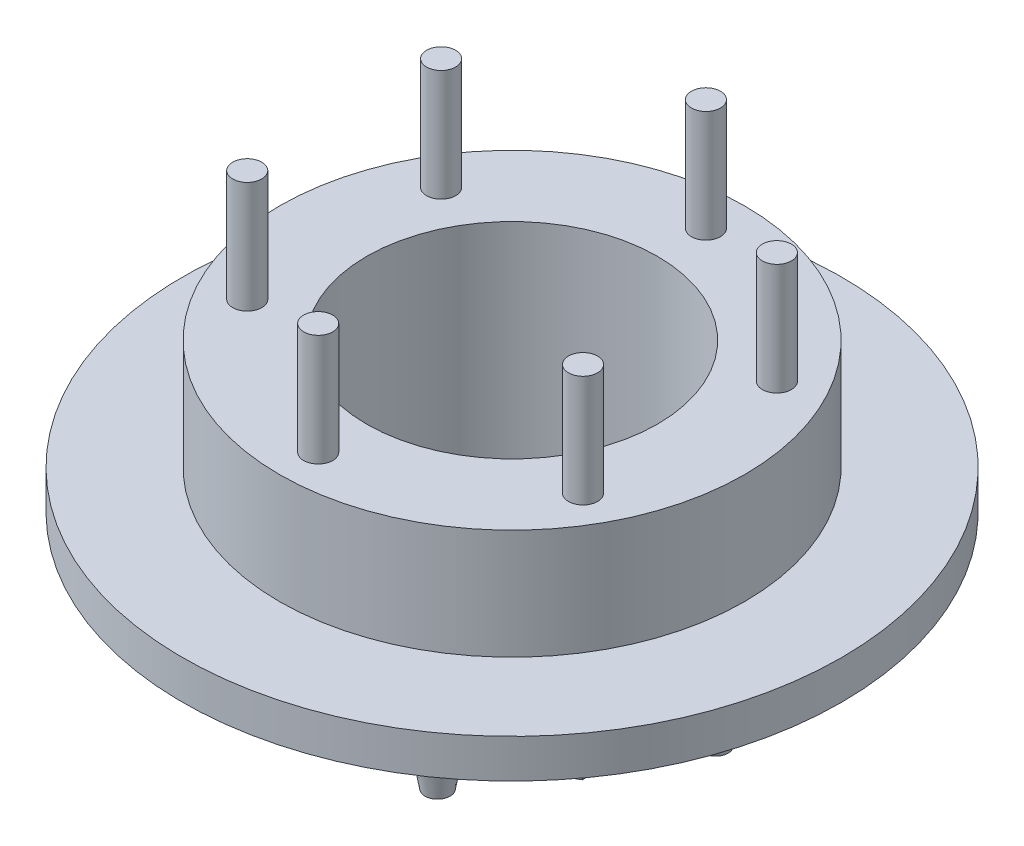
ISO-10303-21;
HEADER;
FILE_DESCRIPTION(('STEP AP214'),'2;1');
FILE_NAME('part.step','',(''),(''),'','','');
FILE_SCHEMA(('AUTOMOTIVE_DESIGN { 1 0 10303 214 1 1 1 1 }'));
ENDSEC;
DATA;
#1=APPLICATION_CONTEXT('core data for automotive mechanical design processes');
#2=APPLICATION_PROTOCOL_DEFINITION('international standard','automotive_design',2000,#1);
#3=PRODUCT_CONTEXT('',#1,'mechanical');
#4=PRODUCT('Part','Part','',(#3));
#5=PRODUCT_RELATED_PRODUCT_CATEGORY('part','',(#4));
#6=PRODUCT_DEFINITION_FORMATION('','',#4);
#7=PRODUCT_DEFINITION_CONTEXT('part definition',#1,'design');
#8=PRODUCT_DEFINITION('design','',#6,#7);
#9=PRODUCT_DEFINITION_SHAPE('','',#8);
#10=(LENGTH_UNIT() NAMED_UNIT(*) SI_UNIT(.MILLI.,.METRE.));
#11=(NAMED_UNIT(*) PLANE_ANGLE_UNIT() SI_UNIT($,.RADIAN.));
#12=(NAMED_UNIT(*) SI_UNIT($,.STERADIAN.) SOLID_ANGLE_UNIT());
#13=UNCERTAINTY_MEASURE_WITH_UNIT(LENGTH_MEASURE(1.E-05),#10,'distance_accuracy_value','');
#14=(GEOMETRIC_REPRESENTATION_CONTEXT(3) GLOBAL_UNCERTAINTY_ASSIGNED_CONTEXT((#13)) GLOBAL_UNIT_ASSIGNED_CONTEXT((#10,
#11,#12)) REPRESENTATION_CONTEXT('',''));
#15=CARTESIAN_POINT('',(0.,0.,0.));
#16=DIRECTION('',(0.,0.,1.));
#17=DIRECTION('',(1.,0.,0.));
#18=AXIS2_PLACEMENT_3D('',#15,#16,#17);
#19=CARTESIAN_POINT('',(0.,10.875,0.));
#20=DIRECTION('',(0.,-1.,0.));
#21=DIRECTION('',(0.,0.,-1.));
#22=AXIS2_PLACEMENT_3D('',#19,#20,#21);
#23=CYLINDRICAL_SURFACE('',#22,12.);
#24=CARTESIAN_POINT('',(0.,5.19999999999999,0.));
#25=DIRECTION('',(0.,-1.,0.));
#26=DIRECTION('',(1.,0.,0.));
#27=AXIS2_PLACEMENT_3D('',#24,#25,#26);
#28=CIRCLE('',#27,12.);
#29=CARTESIAN_POINT('',(12.,5.2,0.));
#30=VERTEX_POINT('',#29);
#31=EDGE_CURVE('E230',#30,#30,#28,.T.);
#32=ORIENTED_EDGE('',*,*,#31,.F.);
#33=EDGE_LOOP('',(#32));
#34=FACE_BOUND('',#33,.T.);
#35=CARTESIAN_POINT('',(0.,10.875,0.));
#36=DIRECTION('',(0.,1.,0.));
#37=DIRECTION('',(0.,0.,1.));
#38=AXIS2_PLACEMENT_3D('',#35,#36,#37);
#39=CIRCLE('',#38,12.);
#40=CARTESIAN_POINT('',(0.,10.875,12.));
#41=VERTEX_POINT('',#40);
#42=EDGE_CURVE('E152',#41,#41,#39,.T.);
#43=ORIENTED_EDGE('',*,*,#42,.F.);
#44=EDGE_LOOP('',(#43));
#45=FACE_BOUND('',#44,.T.);
#46=ADVANCED_FACE('F32',(#34,#45),#23,.T.);
#47=CARTESIAN_POINT('',(0.,0.,0.));
#48=DIRECTION('',(0.,1.,0.));
#49=DIRECTION('',(0.,0.,1.));
#50=AXIS2_PLACEMENT_3D('',#47,#48,#49);
#51=PLANE('',#50);
#52=CARTESIAN_POINT('',(-10.5,0.,0.));
#53=DIRECTION('',(0.,1.,0.));
#54=DIRECTION('',(0.,0.,1.));
#55=AXIS2_PLACEMENT_3D('',#52,#53,#54);
#56=CIRCLE('',#55,1.);
#57=CARTESIAN_POINT('',(-10.5,0.,1.));
#58=VERTEX_POINT('',#57);
#59=EDGE_CURVE('E11',#58,#58,#56,.F.);
#60=ORIENTED_EDGE('',*,*,#59,.F.);
#61=EDGE_LOOP('',(#60));
#62=FACE_BOUND('',#61,.T.);
#63=CARTESIAN_POINT('',(-5.24999999999999,0.,-9.09326673973661));
#64=DIRECTION('',(0.,1.,0.));
#65=DIRECTION('',(0.,0.,1.));
#66=AXIS2_PLACEMENT_3D('',#63,#64,#65);
#67=CIRCLE('',#66,1.);
#68=CARTESIAN_POINT('',(-5.24999999999999,0.,-8.09326673973661));
#69=VERTEX_POINT('',#68);
#70=EDGE_CURVE('E40',#69,#69,#67,.F.);
#71=ORIENTED_EDGE('',*,*,#70,.F.);
#72=EDGE_LOOP('',(#71));
#73=FACE_BOUND('',#72,.T.);
#74=CARTESIAN_POINT('',(5.25,0.,-9.09326673973661));
#75=DIRECTION('',(0.,1.,0.));
#76=DIRECTION('',(0.,0.,1.));
#77=AXIS2_PLACEMENT_3D('',#74,#75,#76);
#78=CIRCLE('',#77,1.);
#79=CARTESIAN_POINT('',(5.25,0.,-8.09326673973661));
#80=VERTEX_POINT('',#79);
#81=EDGE_CURVE('E166',#80,#80,#78,.F.);
#82=ORIENTED_EDGE('',*,*,#81,.F.);
#83=EDGE_LOOP('',(#82));
#84=FACE_BOUND('',#83,.T.);
#85=CARTESIAN_POINT('',(10.5,0.,0.));
#86=DIRECTION('',(0.,1.,0.));
#87=DIRECTION('',(0.,0.,1.));
#88=AXIS2_PLACEMENT_3D('',#85,#86,#87);
#89=CIRCLE('',#88,1.);
#90=CARTESIAN_POINT('',(10.5,0.,1.));
#91=VERTEX_POINT('',#90);
#92=EDGE_CURVE('E163',#91,#91,#89,.F.);
#93=ORIENTED_EDGE('',*,*,#92,.F.);
#94=EDGE_LOOP('',(#93));
#95=FACE_BOUND('',#94,.T.);
#96=CARTESIAN_POINT('',(5.25,0.,9.09326673973661));
#97=DIRECTION('',(0.,1.,0.));
#98=DIRECTION('',(0.,0.,1.));
#99=AXIS2_PLACEMENT_3D('',#96,#97,#98);
#100=CIRCLE('',#99,1.);
#101=CARTESIAN_POINT('',(5.25,0.,10.0932667397366));
#102=VERTEX_POINT('',#101);
#103=EDGE_CURVE('E160',#102,#102,#100,.F.);
#104=ORIENTED_EDGE('',*,*,#103,.F.);
#105=EDGE_LOOP('',(#104));
#106=FACE_BOUND('',#105,.T.);
#107=CARTESIAN_POINT('',(-5.25,0.,9.09326673973661));
#108=DIRECTION('',(0.,1.,0.));
#109=DIRECTION('',(0.,0.,1.));
#110=AXIS2_PLACEMENT_3D('',#107,#108,#109);
#111=CIRCLE('',#110,1.);
#112=CARTESIAN_POINT('',(-5.25,0.,10.0932667397366));
#113=VERTEX_POINT('',#112);
#114=EDGE_CURVE('E155',#113,#113,#111,.F.);
#115=ORIENTED_EDGE('',*,*,#114,.F.);
#116=EDGE_LOOP('',(#115));
#117=FACE_BOUND('',#116,.T.);
#118=CARTESIAN_POINT('',(0.,0.,0.));
#119=DIRECTION('',(0.,1.,0.));
#120=DIRECTION('',(0.,0.,1.));
#121=AXIS2_PLACEMENT_3D('',#118,#119,#120);
#122=CIRCLE('',#121,12.);
#123=CARTESIAN_POINT('',(0.,0.,12.));
#124=VERTEX_POINT('',#123);
#125=EDGE_CURVE('E151',#124,#124,#122,.T.);
#126=ORIENTED_EDGE('',*,*,#125,.F.);
#127=EDGE_LOOP('',(#126));
#128=FACE_BOUND('',#127,.T.);
#129=DIRECTION('',(-0.866025403784439,0.,0.5));
#130=VECTOR('',#129,1.);
#131=CARTESIAN_POINT('',(8.57365149746594,0.,4.95));
#132=LINE('',#131,#130);
#133=CARTESIAN_POINT('',(8.57365149746594,0.,4.95));
#134=VERTEX_POINT('',#133);
#135=CARTESIAN_POINT('',(0.,0.,9.9));
#136=VERTEX_POINT('',#135);
#137=EDGE_CURVE('E106',#134,#136,#132,.T.);
#138=ORIENTED_EDGE('',*,*,#137,.F.);
#139=DIRECTION('',(0.,0.,1.));
#140=VECTOR('',#139,1.);
#141=CARTESIAN_POINT('',(8.57365149746594,0.,-4.95));
#142=LINE('',#141,#140);
#143=CARTESIAN_POINT('',(8.57365149746594,0.,-4.95));
#144=VERTEX_POINT('',#143);
#145=EDGE_CURVE('E103',#144,#134,#142,.T.);
#146=ORIENTED_EDGE('',*,*,#145,.F.);
#147=DIRECTION('',(0.866025403784439,0.,0.5));
#148=VECTOR('',#147,1.);
#149=CARTESIAN_POINT('',(0.,0.,-9.9));
#150=LINE('',#149,#148);
#151=CARTESIAN_POINT('',(0.,0.,-9.9));
#152=VERTEX_POINT('',#151);
#153=EDGE_CURVE('E197',#152,#144,#150,.T.);
#154=ORIENTED_EDGE('',*,*,#153,.F.);
#155=DIRECTION('',(0.866025403784439,0.,-0.5));
#156=VECTOR('',#155,1.);
#157=CARTESIAN_POINT('',(-8.57365149746594,0.,-4.95));
#158=LINE('',#157,#156);
#159=CARTESIAN_POINT('',(-8.57365149746594,0.,-4.95));
#160=VERTEX_POINT('',#159);
#161=EDGE_CURVE('E214',#160,#152,#158,.T.);
#162=ORIENTED_EDGE('',*,*,#161,.F.);
#163=DIRECTION('',(0.,0.,-1.));
#164=VECTOR('',#163,1.);
#165=CARTESIAN_POINT('',(-8.57365149746594,0.,4.95));
#166=LINE('',#165,#164);
#167=CARTESIAN_POINT('',(-8.57365149746594,0.,4.95));
#168=VERTEX_POINT('',#167);
#169=EDGE_CURVE('E52',#168,#160,#166,.T.);
#170=ORIENTED_EDGE('',*,*,#169,.F.);
#171=DIRECTION('',(-0.866025403784439,0.,-0.5));
#172=VECTOR('',#171,1.);
#173=CARTESIAN_POINT('',(0.,0.,9.9));
#174=LINE('',#173,#172);
#175=EDGE_CURVE('E47',#136,#168,#174,.T.);
#176=ORIENTED_EDGE('',*,*,#175,.F.);
#177=EDGE_LOOP('',(#138,#146,#154,#162,#170,#176));
#178=FACE_BOUND('',#177,.T.);
#179=ADVANCED_FACE('F173',(#62,#73,#84,#95,#106,#117,#128,#178),#51,.F.);
#180=CARTESIAN_POINT('',(0.,10.875,0.));
#181=DIRECTION('',(0.,1.,0.));
#182=DIRECTION('',(0.,0.,1.));
#183=AXIS2_PLACEMENT_3D('',#180,#181,#182);
#184=PLANE('',#183);
#185=CARTESIAN_POINT('',(8.66025403784439,10.875,-5.00000000000001));
#186=DIRECTION('',(0.,1.,0.));
#187=DIRECTION('',(0.,0.,1.));
#188=AXIS2_PLACEMENT_3D('',#185,#186,#187);
#189=CIRCLE('',#188,0.75);
#190=CARTESIAN_POINT('',(8.66025403784439,10.875,-4.25));
#191=VERTEX_POINT('',#190);
#192=EDGE_CURVE('E107',#191,#191,#189,.T.);
#193=ORIENTED_EDGE('',*,*,#192,.F.);
#194=EDGE_LOOP('',(#193));
#195=FACE_BOUND('',#194,.T.);
#196=CARTESIAN_POINT('',(8.66025403784439,10.875,5.));
#197=DIRECTION('',(0.,1.,0.));
#198=DIRECTION('',(0.,0.,1.));
#199=AXIS2_PLACEMENT_3D('',#196,#197,#198);
#200=CIRCLE('',#199,0.75);
#201=CARTESIAN_POINT('',(8.66025403784439,10.875,5.75));
#202=VERTEX_POINT('',#201);
#203=EDGE_CURVE('E117',#202,#202,#200,.T.);
#204=ORIENTED_EDGE('',*,*,#203,.F.);
#205=EDGE_LOOP('',(#204));
#206=FACE_BOUND('',#205,.T.);
#207=CARTESIAN_POINT('',(0.,10.875,10.));
#208=DIRECTION('',(0.,1.,0.));
#209=DIRECTION('',(0.,0.,1.));
#210=AXIS2_PLACEMENT_3D('',#207,#208,#209);
#211=CIRCLE('',#210,0.75);
#212=CARTESIAN_POINT('',(0.,10.875,10.75));
#213=VERTEX_POINT('',#212);
#214=EDGE_CURVE('E122',#213,#213,#211,.T.);
#215=ORIENTED_EDGE('',*,*,#214,.F.);
#216=EDGE_LOOP('',(#215));
#217=FACE_BOUND('',#216,.T.);
#218=CARTESIAN_POINT('',(-8.66025403784439,10.875,5.));
#219=DIRECTION('',(0.,1.,0.));
#220=DIRECTION('',(0.,0.,1.));
#221=AXIS2_PLACEMENT_3D('',#218,#219,#220);
#222=CIRCLE('',#221,0.75);
#223=CARTESIAN_POINT('',(-8.66025403784439,10.875,5.75));
#224=VERTEX_POINT('',#223);
#225=EDGE_CURVE('E128',#224,#224,#222,.T.);
#226=ORIENTED_EDGE('',*,*,#225,.F.);
#227=EDGE_LOOP('',(#226));
#228=FACE_BOUND('',#227,.T.);
#229=CARTESIAN_POINT('',(-8.66025403784439,10.875,-5.));
#230=DIRECTION('',(0.,1.,0.));
#231=DIRECTION('',(0.,0.,1.));
#232=AXIS2_PLACEMENT_3D('',#229,#230,#231);
#233=CIRCLE('',#232,0.75);
#234=CARTESIAN_POINT('',(-8.66025403784439,10.875,-4.25));
#235=VERTEX_POINT('',#234);
#236=EDGE_CURVE('E134',#235,#235,#233,.T.);
#237=ORIENTED_EDGE('',*,*,#236,.F.);
#238=EDGE_LOOP('',(#237));
#239=FACE_BOUND('',#238,.T.);
#240=CARTESIAN_POINT('',(0.,10.875,-10.));
#241=DIRECTION('',(0.,1.,0.));
#242=DIRECTION('',(0.,0.,1.));
#243=AXIS2_PLACEMENT_3D('',#240,#241,#242);
#244=CIRCLE('',#243,0.75);
#245=CARTESIAN_POINT('',(0.,10.875,-9.25));
#246=VERTEX_POINT('',#245);
#247=EDGE_CURVE('E140',#246,#246,#244,.T.);
#248=ORIENTED_EDGE('',*,*,#247,.F.);
#249=EDGE_LOOP('',(#248));
#250=FACE_BOUND('',#249,.T.);
#251=ORIENTED_EDGE('',*,*,#42,.T.);
#252=EDGE_LOOP('',(#251));
#253=FACE_BOUND('',#252,.T.);
#254=CARTESIAN_POINT('',(0.,10.875,0.));
#255=DIRECTION('',(0.,1.,0.));
#256=DIRECTION('',(0.,0.,1.));
#257=AXIS2_PLACEMENT_3D('',#254,#255,#256);
#258=CIRCLE('',#257,7.5);
#259=CARTESIAN_POINT('',(0.,10.875,7.5));
#260=VERTEX_POINT('',#259);
#261=EDGE_CURVE('E146',#260,#260,#258,.T.);
#262=ORIENTED_EDGE('',*,*,#261,.F.);
#263=EDGE_LOOP('',(#262));
#264=FACE_BOUND('',#263,.T.);
#265=ADVANCED_FACE('F176',(#195,#206,#217,#228,#239,#250,#253,#264),#184,.T.);
#266=CARTESIAN_POINT('',(0.,3.19999999999999,0.));
#267=DIRECTION('',(0.,-1.,0.));
#268=DIRECTION('',(1.,0.,0.));
#269=AXIS2_PLACEMENT_3D('',#266,#267,#268);
#270=CIRCLE('',#269,12.);
#271=CARTESIAN_POINT('',(12.,3.2,0.));
#272=VERTEX_POINT('',#271);
#273=EDGE_CURVE('E239',#272,#272,#270,.T.);
#274=ORIENTED_EDGE('',*,*,#273,.T.);
#275=EDGE_LOOP('',(#274));
#276=FACE_BOUND('',#275,.T.);
#277=ORIENTED_EDGE('',*,*,#125,.T.);
#278=EDGE_LOOP('',(#277));
#279=FACE_BOUND('',#278,.T.);
#280=ADVANCED_FACE('F34',(#276,#279),#23,.T.);
#281=CARTESIAN_POINT('',(0.,10.875,0.));
#282=DIRECTION('',(0.,-1.,0.));
#283=DIRECTION('',(0.,0.,-1.));
#284=AXIS2_PLACEMENT_3D('',#281,#282,#283);
#285=CYLINDRICAL_SURFACE('',#284,7.5);
#286=ORIENTED_EDGE('',*,*,#261,.T.);
#287=EDGE_LOOP('',(#286));
#288=FACE_BOUND('',#287,.T.);
#289=CARTESIAN_POINT('',(0.,-2.,0.));
#290=DIRECTION('',(0.,-1.,0.));
#291=DIRECTION('',(0.,0.,-1.));
#292=AXIS2_PLACEMENT_3D('',#289,#290,#291);
#293=CIRCLE('',#292,7.5);
#294=CARTESIAN_POINT('',(0.,-2.,-7.5));
#295=VERTEX_POINT('',#294);
#296=EDGE_CURVE('E189',#295,#295,#293,.T.);
#297=ORIENTED_EDGE('',*,*,#296,.T.);
#298=EDGE_LOOP('',(#297));
#299=FACE_BOUND('',#298,.T.);
#300=ADVANCED_FACE('F283',(#288,#299),#285,.F.);
#301=CARTESIAN_POINT('',(0.,16.625,-10.));
#302=DIRECTION('',(0.,-1.,0.));
#303=DIRECTION('',(0.,0.,-1.));
#304=AXIS2_PLACEMENT_3D('',#301,#302,#303);
#305=CYLINDRICAL_SURFACE('',#304,0.75);
#306=CARTESIAN_POINT('',(0.,16.625,-10.));
#307=DIRECTION('',(0.,1.,0.));
#308=DIRECTION('',(0.,0.,1.));
#309=AXIS2_PLACEMENT_3D('',#306,#307,#308);
#310=CIRCLE('',#309,0.75);
#311=CARTESIAN_POINT('',(0.,16.625,-9.25));
#312=VERTEX_POINT('',#311);
#313=EDGE_CURVE('E143',#312,#312,#310,.T.);
#314=ORIENTED_EDGE('',*,*,#313,.F.);
#315=EDGE_LOOP('',(#314));
#316=FACE_BOUND('',#315,.T.);
#317=ORIENTED_EDGE('',*,*,#247,.T.);
#318=EDGE_LOOP('',(#317));
#319=FACE_BOUND('',#318,.T.);
#320=ADVANCED_FACE('F289',(#316,#319),#305,.T.);
#321=CARTESIAN_POINT('',(0.,16.625,-10.));
#322=DIRECTION('',(0.,1.,0.));
#323=DIRECTION('',(0.,0.,1.));
#324=AXIS2_PLACEMENT_3D('',#321,#322,#323);
#325=PLANE('',#324);
#326=ORIENTED_EDGE('',*,*,#313,.T.);
#327=EDGE_LOOP('',(#326));
#328=FACE_BOUND('',#327,.T.);
#329=ADVANCED_FACE('F371',(#328),#325,.T.);
#330=CARTESIAN_POINT('',(-8.66025403784439,16.625,-5.));
#331=DIRECTION('',(0.,-1.,0.));
#332=DIRECTION('',(0.,0.,-1.));
#333=AXIS2_PLACEMENT_3D('',#330,#331,#332);
#334=CYLINDRICAL_SURFACE('',#333,0.75);
#335=CARTESIAN_POINT('',(-8.66025403784439,16.625,-5.));
#336=DIRECTION('',(0.,1.,0.));
#337=DIRECTION('',(0.,0.,1.));
#338=AXIS2_PLACEMENT_3D('',#335,#336,#337);
#339=CIRCLE('',#338,0.75);
#340=CARTESIAN_POINT('',(-8.66025403784439,16.625,-4.25));
#341=VERTEX_POINT('',#340);
#342=EDGE_CURVE('E137',#341,#341,#339,.T.);
#343=ORIENTED_EDGE('',*,*,#342,.F.);
#344=EDGE_LOOP('',(#343));
#345=FACE_BOUND('',#344,.T.);
#346=ORIENTED_EDGE('',*,*,#236,.T.);
#347=EDGE_LOOP('',(#346));
#348=FACE_BOUND('',#347,.T.);
#349=ADVANCED_FACE('F367',(#345,#348),#334,.T.);
#350=CARTESIAN_POINT('',(-8.66025403784439,16.625,-5.));
#351=DIRECTION('',(0.,1.,0.));
#352=DIRECTION('',(0.,0.,1.));
#353=AXIS2_PLACEMENT_3D('',#350,#351,#352);
#354=PLANE('',#353);
#355=ORIENTED_EDGE('',*,*,#342,.T.);
#356=EDGE_LOOP('',(#355));
#357=FACE_BOUND('',#356,.T.);
#358=ADVANCED_FACE('F363',(#357),#354,.T.);
#359=CARTESIAN_POINT('',(-8.66025403784439,16.625,5.));
#360=DIRECTION('',(0.,-1.,0.));
#361=DIRECTION('',(0.,0.,-1.));
#362=AXIS2_PLACEMENT_3D('',#359,#360,#361);
#363=CYLINDRICAL_SURFACE('',#362,0.75);
#364=CARTESIAN_POINT('',(-8.66025403784439,16.625,5.));
#365=DIRECTION('',(0.,1.,0.));
#366=DIRECTION('',(0.,0.,1.));
#367=AXIS2_PLACEMENT_3D('',#364,#365,#366);
#368=CIRCLE('',#367,0.75);
#369=CARTESIAN_POINT('',(-8.66025403784439,16.625,5.75));
#370=VERTEX_POINT('',#369);
#371=EDGE_CURVE('E131',#370,#370,#368,.T.);
#372=ORIENTED_EDGE('',*,*,#371,.F.);
#373=EDGE_LOOP('',(#372));
#374=FACE_BOUND('',#373,.T.);
#375=ORIENTED_EDGE('',*,*,#225,.T.);
#376=EDGE_LOOP('',(#375));
#377=FACE_BOUND('',#376,.T.);
#378=ADVANCED_FACE('F359',(#374,#377),#363,.T.);
#379=CARTESIAN_POINT('',(-8.66025403784439,16.625,5.));
#380=DIRECTION('',(0.,1.,0.));
#381=DIRECTION('',(0.,0.,1.));
#382=AXIS2_PLACEMENT_3D('',#379,#380,#381);
#383=PLANE('',#382);
#384=ORIENTED_EDGE('',*,*,#371,.T.);
#385=EDGE_LOOP('',(#384));
#386=FACE_BOUND('',#385,.T.);
#387=ADVANCED_FACE('F355',(#386),#383,.T.);
#388=CARTESIAN_POINT('',(0.,16.625,10.));
#389=DIRECTION('',(0.,-1.,0.));
#390=DIRECTION('',(0.,0.,-1.));
#391=AXIS2_PLACEMENT_3D('',#388,#389,#390);
#392=CYLINDRICAL_SURFACE('',#391,0.75);
#393=CARTESIAN_POINT('',(0.,16.625,10.));
#394=DIRECTION('',(0.,1.,0.));
#395=DIRECTION('',(0.,0.,1.));
#396=AXIS2_PLACEMENT_3D('',#393,#394,#395);
#397=CIRCLE('',#396,0.75);
#398=CARTESIAN_POINT('',(0.,16.625,10.75));
#399=VERTEX_POINT('',#398);
#400=EDGE_CURVE('E125',#399,#399,#397,.T.);
#401=ORIENTED_EDGE('',*,*,#400,.F.);
#402=EDGE_LOOP('',(#401));
#403=FACE_BOUND('',#402,.T.);
#404=ORIENTED_EDGE('',*,*,#214,.T.);
#405=EDGE_LOOP('',(#404));
#406=FACE_BOUND('',#405,.T.);
#407=ADVANCED_FACE('F351',(#403,#406),#392,.T.);
#408=CARTESIAN_POINT('',(0.,16.625,10.));
#409=DIRECTION('',(0.,1.,0.));
#410=DIRECTION('',(0.,0.,1.));
#411=AXIS2_PLACEMENT_3D('',#408,#409,#410);
#412=PLANE('',#411);
#413=ORIENTED_EDGE('',*,*,#400,.T.);
#414=EDGE_LOOP('',(#413));
#415=FACE_BOUND('',#414,.T.);
#416=ADVANCED_FACE('F347',(#415),#412,.T.);
#417=CARTESIAN_POINT('',(8.66025403784439,16.625,5.));
#418=DIRECTION('',(0.,-1.,0.));
#419=DIRECTION('',(0.,0.,-1.));
#420=AXIS2_PLACEMENT_3D('',#417,#418,#419);
#421=CYLINDRICAL_SURFACE('',#420,0.75);
#422=CARTESIAN_POINT('',(8.66025403784439,16.625,5.));
#423=DIRECTION('',(0.,1.,0.));
#424=DIRECTION('',(0.,0.,1.));
#425=AXIS2_PLACEMENT_3D('',#422,#423,#424);
#426=CIRCLE('',#425,0.75);
#427=CARTESIAN_POINT('',(8.66025403784439,16.625,5.75));
#428=VERTEX_POINT('',#427);
#429=EDGE_CURVE('E119',#428,#428,#426,.T.);
#430=ORIENTED_EDGE('',*,*,#429,.F.);
#431=EDGE_LOOP('',(#430));
#432=FACE_BOUND('',#431,.T.);
#433=ORIENTED_EDGE('',*,*,#203,.T.);
#434=EDGE_LOOP('',(#433));
#435=FACE_BOUND('',#434,.T.);
#436=ADVANCED_FACE('F343',(#432,#435),#421,.T.);
#437=CARTESIAN_POINT('',(8.66025403784439,16.625,5.));
#438=DIRECTION('',(0.,1.,0.));
#439=DIRECTION('',(0.,0.,1.));
#440=AXIS2_PLACEMENT_3D('',#437,#438,#439);
#441=PLANE('',#440);
#442=ORIENTED_EDGE('',*,*,#429,.T.);
#443=EDGE_LOOP('',(#442));
#444=FACE_BOUND('',#443,.T.);
#445=ADVANCED_FACE('F339',(#444),#441,.T.);
#446=CARTESIAN_POINT('',(8.66025403784439,16.625,-5.00000000000001));
#447=DIRECTION('',(0.,-1.,0.));
#448=DIRECTION('',(0.,0.,-1.));
#449=AXIS2_PLACEMENT_3D('',#446,#447,#448);
#450=CYLINDRICAL_SURFACE('',#449,0.75);
#451=CARTESIAN_POINT('',(8.66025403784439,16.625,-5.00000000000001));
#452=DIRECTION('',(0.,1.,0.));
#453=DIRECTION('',(0.,0.,1.));
#454=AXIS2_PLACEMENT_3D('',#451,#452,#453);
#455=CIRCLE('',#454,0.75);
#456=CARTESIAN_POINT('',(8.66025403784439,16.625,-4.25));
#457=VERTEX_POINT('',#456);
#458=EDGE_CURVE('E110',#457,#457,#455,.T.);
#459=ORIENTED_EDGE('',*,*,#458,.F.);
#460=EDGE_LOOP('',(#459));
#461=FACE_BOUND('',#460,.T.);
#462=ORIENTED_EDGE('',*,*,#192,.T.);
#463=EDGE_LOOP('',(#462));
#464=FACE_BOUND('',#463,.T.);
#465=ADVANCED_FACE('F335',(#461,#464),#450,.T.);
#466=CARTESIAN_POINT('',(8.66025403784439,16.625,-5.00000000000001));
#467=DIRECTION('',(0.,1.,0.));
#468=DIRECTION('',(0.,0.,1.));
#469=AXIS2_PLACEMENT_3D('',#466,#467,#468);
#470=PLANE('',#469);
#471=ORIENTED_EDGE('',*,*,#458,.T.);
#472=EDGE_LOOP('',(#471));
#473=FACE_BOUND('',#472,.T.);
#474=ADVANCED_FACE('F320',(#473),#470,.T.);
#475=CARTESIAN_POINT('',(0.,-2.,0.));
#476=DIRECTION('',(0.,-1.,0.));
#477=DIRECTION('',(0.,0.,-1.));
#478=AXIS2_PLACEMENT_3D('',#475,#476,#477);
#479=PLANE('',#478);
#480=DIRECTION('',(-0.866025403784439,0.,0.5));
#481=VECTOR('',#480,1.);
#482=CARTESIAN_POINT('',(8.57365149746594,-2.,4.95));
#483=LINE('',#482,#481);
#484=CARTESIAN_POINT('',(8.57365149746594,-2.,4.95));
#485=VERTEX_POINT('',#484);
#486=CARTESIAN_POINT('',(0.,-2.,9.9));
#487=VERTEX_POINT('',#486);
#488=EDGE_CURVE('E93',#485,#487,#483,.T.);
#489=ORIENTED_EDGE('',*,*,#488,.T.);
#490=DIRECTION('',(-0.866025403784439,0.,-0.5));
#491=VECTOR('',#490,1.);
#492=CARTESIAN_POINT('',(0.,-2.,9.9));
#493=LINE('',#492,#491);
#494=CARTESIAN_POINT('',(-8.57365149746594,-2.,4.95));
#495=VERTEX_POINT('',#494);
#496=EDGE_CURVE('E82',#487,#495,#493,.T.);
#497=ORIENTED_EDGE('',*,*,#496,.T.);
#498=DIRECTION('',(0.,0.,-1.));
#499=VECTOR('',#498,1.);
#500=CARTESIAN_POINT('',(-8.57365149746594,-2.,4.95));
#501=LINE('',#500,#499);
#502=CARTESIAN_POINT('',(-8.57365149746594,-2.,-4.95));
#503=VERTEX_POINT('',#502);
#504=EDGE_CURVE('E92',#495,#503,#501,.T.);
#505=ORIENTED_EDGE('',*,*,#504,.T.);
#506=DIRECTION('',(0.866025403784439,0.,-0.5));
#507=VECTOR('',#506,1.);
#508=CARTESIAN_POINT('',(-8.57365149746594,-2.,-4.95));
#509=LINE('',#508,#507);
#510=CARTESIAN_POINT('',(0.,-2.,-9.9));
#511=VERTEX_POINT('',#510);
#512=EDGE_CURVE('E215',#503,#511,#509,.T.);
#513=ORIENTED_EDGE('',*,*,#512,.T.);
#514=DIRECTION('',(0.866025403784439,0.,0.5));
#515=VECTOR('',#514,1.);
#516=CARTESIAN_POINT('',(0.,-2.,-9.9));
#517=LINE('',#516,#515);
#518=CARTESIAN_POINT('',(8.57365149746594,-2.,-4.95));
#519=VERTEX_POINT('',#518);
#520=EDGE_CURVE('E202',#511,#519,#517,.T.);
#521=ORIENTED_EDGE('',*,*,#520,.T.);
#522=DIRECTION('',(0.,0.,1.));
#523=VECTOR('',#522,1.);
#524=CARTESIAN_POINT('',(8.57365149746594,-2.,-4.95));
#525=LINE('',#524,#523);
#526=EDGE_CURVE('E99',#519,#485,#525,.T.);
#527=ORIENTED_EDGE('',*,*,#526,.T.);
#528=EDGE_LOOP('',(#489,#497,#505,#513,#521,#527));
#529=FACE_BOUND('',#528,.T.);
#530=ORIENTED_EDGE('',*,*,#296,.F.);
#531=EDGE_LOOP('',(#530));
#532=FACE_BOUND('',#531,.T.);
#533=ADVANCED_FACE('F96',(#529,#532),#479,.T.);
#534=CARTESIAN_POINT('',(8.57365149746594,-2.,4.95));
#535=DIRECTION('',(-0.5,0.,-0.866025403784439));
#536=DIRECTION('',(-0.866025403784439,0.,0.5));
#537=AXIS2_PLACEMENT_3D('',#534,#535,#536);
#538=PLANE('',#537);
#539=ORIENTED_EDGE('',*,*,#137,.T.);
#540=DIRECTION('',(0.,1.,0.));
#541=VECTOR('',#540,1.);
#542=CARTESIAN_POINT('',(0.,-2.,9.9));
#543=LINE('',#542,#541);
#544=EDGE_CURVE('E86',#487,#136,#543,.T.);
#545=ORIENTED_EDGE('',*,*,#544,.F.);
#546=ORIENTED_EDGE('',*,*,#488,.F.);
#547=DIRECTION('',(0.,1.,0.));
#548=VECTOR('',#547,1.);
#549=CARTESIAN_POINT('',(8.57365149746594,-2.,4.95));
#550=LINE('',#549,#548);
#551=EDGE_CURVE('E194',#485,#134,#550,.T.);
#552=ORIENTED_EDGE('',*,*,#551,.T.);
#553=EDGE_LOOP('',(#539,#545,#546,#552));
#554=FACE_BOUND('',#553,.T.);
#555=ADVANCED_FACE('F105',(#554),#538,.F.);
#556=CARTESIAN_POINT('',(0.,-2.,9.9));
#557=DIRECTION('',(0.5,0.,-0.866025403784439));
#558=DIRECTION('',(-0.866025403784439,0.,-0.5));
#559=AXIS2_PLACEMENT_3D('',#556,#557,#558);
#560=PLANE('',#559);
#561=ORIENTED_EDGE('',*,*,#175,.T.);
#562=DIRECTION('',(0.,1.,0.));
#563=VECTOR('',#562,1.);
#564=CARTESIAN_POINT('',(-8.57365149746594,-2.,4.95));
#565=LINE('',#564,#563);
#566=EDGE_CURVE('E89',#495,#168,#565,.T.);
#567=ORIENTED_EDGE('',*,*,#566,.F.);
#568=ORIENTED_EDGE('',*,*,#496,.F.);
#569=ORIENTED_EDGE('',*,*,#544,.T.);
#570=EDGE_LOOP('',(#561,#567,#568,#569));
#571=FACE_BOUND('',#570,.T.);
#572=ADVANCED_FACE('F84',(#571),#560,.F.);
#573=CARTESIAN_POINT('',(-8.57365149746594,-2.,4.95));
#574=DIRECTION('',(1.,0.,0.));
#575=DIRECTION('',(0.,0.,-1.));
#576=AXIS2_PLACEMENT_3D('',#573,#574,#575);
#577=PLANE('',#576);
#578=ORIENTED_EDGE('',*,*,#169,.T.);
#579=DIRECTION('',(0.,1.,0.));
#580=VECTOR('',#579,1.);
#581=CARTESIAN_POINT('',(-8.57365149746594,-2.,-4.95));
#582=LINE('',#581,#580);
#583=EDGE_CURVE('E112',#503,#160,#582,.T.);
#584=ORIENTED_EDGE('',*,*,#583,.F.);
#585=ORIENTED_EDGE('',*,*,#504,.F.);
#586=ORIENTED_EDGE('',*,*,#566,.T.);
#587=EDGE_LOOP('',(#578,#584,#585,#586));
#588=FACE_BOUND('',#587,.T.);
#589=ADVANCED_FACE('F217',(#588),#577,.F.);
#590=CARTESIAN_POINT('',(-8.57365149746594,-2.,-4.95));
#591=DIRECTION('',(0.5,0.,0.866025403784439));
#592=DIRECTION('',(0.866025403784439,0.,-0.5));
#593=AXIS2_PLACEMENT_3D('',#590,#591,#592);
#594=PLANE('',#593);
#595=ORIENTED_EDGE('',*,*,#161,.T.);
#596=DIRECTION('',(0.,1.,0.));
#597=VECTOR('',#596,1.);
#598=CARTESIAN_POINT('',(0.,-2.,-9.9));
#599=LINE('',#598,#597);
#600=EDGE_CURVE('E200',#511,#152,#599,.T.);
#601=ORIENTED_EDGE('',*,*,#600,.F.);
#602=ORIENTED_EDGE('',*,*,#512,.F.);
#603=ORIENTED_EDGE('',*,*,#583,.T.);
#604=EDGE_LOOP('',(#595,#601,#602,#603));
#605=FACE_BOUND('',#604,.T.);
#606=ADVANCED_FACE('F212',(#605),#594,.F.);
#607=CARTESIAN_POINT('',(0.,-2.,-9.9));
#608=DIRECTION('',(-0.5,0.,0.866025403784439));
#609=DIRECTION('',(0.866025403784439,0.,0.5));
#610=AXIS2_PLACEMENT_3D('',#607,#608,#609);
#611=PLANE('',#610);
#612=ORIENTED_EDGE('',*,*,#153,.T.);
#613=DIRECTION('',(0.,1.,0.));
#614=VECTOR('',#613,1.);
#615=CARTESIAN_POINT('',(8.57365149746594,-2.,-4.95));
#616=LINE('',#615,#614);
#617=EDGE_CURVE('E196',#519,#144,#616,.T.);
#618=ORIENTED_EDGE('',*,*,#617,.F.);
#619=ORIENTED_EDGE('',*,*,#520,.F.);
#620=ORIENTED_EDGE('',*,*,#600,.T.);
#621=EDGE_LOOP('',(#612,#618,#619,#620));
#622=FACE_BOUND('',#621,.T.);
#623=ADVANCED_FACE('F222',(#622),#611,.F.);
#624=CARTESIAN_POINT('',(8.57365149746594,-2.,-4.95));
#625=DIRECTION('',(-1.,0.,0.));
#626=DIRECTION('',(0.,0.,1.));
#627=AXIS2_PLACEMENT_3D('',#624,#625,#626);
#628=PLANE('',#627);
#629=ORIENTED_EDGE('',*,*,#145,.T.);
#630=ORIENTED_EDGE('',*,*,#551,.F.);
#631=ORIENTED_EDGE('',*,*,#526,.F.);
#632=ORIENTED_EDGE('',*,*,#617,.T.);
#633=EDGE_LOOP('',(#629,#630,#631,#632));
#634=FACE_BOUND('',#633,.T.);
#635=ADVANCED_FACE('F193',(#634),#628,.F.);
#636=CARTESIAN_POINT('',(12.,5.2,0.));
#637=DIRECTION('',(0.,1.,0.));
#638=DIRECTION('',(-1.,0.,0.));
#639=AXIS2_PLACEMENT_3D('',#636,#637,#638);
#640=PLANE('',#639);
#641=ORIENTED_EDGE('',*,*,#31,.T.);
#642=EDGE_LOOP('',(#641));
#643=FACE_BOUND('',#642,.T.);
#644=CARTESIAN_POINT('',(0.,5.19999999999999,0.));
#645=DIRECTION('',(0.,-1.,0.));
#646=DIRECTION('',(1.,0.,0.));
#647=AXIS2_PLACEMENT_3D('',#644,#645,#646);
#648=CIRCLE('',#647,17.);
#649=CARTESIAN_POINT('',(17.,5.2,0.));
#650=VERTEX_POINT('',#649);
#651=EDGE_CURVE('E233',#650,#650,#648,.T.);
#652=ORIENTED_EDGE('',*,*,#651,.F.);
#653=EDGE_LOOP('',(#652));
#654=FACE_BOUND('',#653,.T.);
#655=ADVANCED_FACE('F310',(#643,#654),#640,.T.);
#656=CARTESIAN_POINT('',(0.,-2.,0.));
#657=DIRECTION('',(0.,-1.,0.));
#658=DIRECTION('',(1.,0.,0.));
#659=AXIS2_PLACEMENT_3D('',#656,#657,#658);
#660=CYLINDRICAL_SURFACE('',#659,17.);
#661=ORIENTED_EDGE('',*,*,#651,.T.);
#662=EDGE_LOOP('',(#661));
#663=FACE_BOUND('',#662,.T.);
#664=CARTESIAN_POINT('',(0.,3.19999999999999,0.));
#665=DIRECTION('',(0.,-1.,0.));
#666=DIRECTION('',(1.,0.,0.));
#667=AXIS2_PLACEMENT_3D('',#664,#665,#666);
#668=CIRCLE('',#667,17.);
#669=CARTESIAN_POINT('',(17.,3.2,0.));
#670=VERTEX_POINT('',#669);
#671=EDGE_CURVE('E236',#670,#670,#668,.T.);
#672=ORIENTED_EDGE('',*,*,#671,.F.);
#673=EDGE_LOOP('',(#672));
#674=FACE_BOUND('',#673,.T.);
#675=ADVANCED_FACE('F300',(#663,#674),#660,.T.);
#676=CARTESIAN_POINT('',(12.,3.2,0.));
#677=DIRECTION('',(0.,-1.,0.));
#678=DIRECTION('',(1.,0.,0.));
#679=AXIS2_PLACEMENT_3D('',#676,#677,#678);
#680=PLANE('',#679);
#681=ORIENTED_EDGE('',*,*,#671,.T.);
#682=EDGE_LOOP('',(#681));
#683=FACE_BOUND('',#682,.T.);
#684=ORIENTED_EDGE('',*,*,#273,.F.);
#685=EDGE_LOOP('',(#684));
#686=FACE_BOUND('',#685,.T.);
#687=ADVANCED_FACE('F297',(#683,#686),#680,.T.);
#688=CARTESIAN_POINT('',(-5.25,0.,9.09326673973661));
#689=DIRECTION('',(0.,1.,0.));
#690=DIRECTION('',(0.,0.,-1.));
#691=AXIS2_PLACEMENT_3D('',#688,#689,#690);
#692=CONICAL_SURFACE('',#691,1.,0.174532925199434);
#693=CARTESIAN_POINT('',(-5.25,-2.,9.09326673973661));
#694=DIRECTION('',(0.,-1.,0.));
#695=DIRECTION('',(0.,0.,-1.));
#696=AXIS2_PLACEMENT_3D('',#693,#694,#695);
#697=CIRCLE('',#696,0.647346038583068);
#698=CARTESIAN_POINT('',(-5.25,-2.,8.44592070115354));
#699=VERTEX_POINT('',#698);
#700=EDGE_CURVE('E242',#699,#699,#697,.T.);
#701=ORIENTED_EDGE('',*,*,#700,.F.);
#702=EDGE_LOOP('',(#701));
#703=FACE_BOUND('',#702,.T.);
#704=ORIENTED_EDGE('',*,*,#114,.T.);
#705=EDGE_LOOP('',(#704));
#706=FACE_BOUND('',#705,.T.);
#707=ADVANCED_FACE('F299',(#703,#706),#692,.T.);
#708=CARTESIAN_POINT('',(-5.25,-2.,9.09326673973661));
#709=DIRECTION('',(0.,-1.,0.));
#710=DIRECTION('',(0.,0.,-1.));
#711=AXIS2_PLACEMENT_3D('',#708,#709,#710);
#712=PLANE('',#711);
#713=ORIENTED_EDGE('',*,*,#700,.T.);
#714=EDGE_LOOP('',(#713));
#715=FACE_BOUND('',#714,.T.);
#716=ADVANCED_FACE('F307',(#715),#712,.T.);
#717=CARTESIAN_POINT('',(5.25,0.,9.09326673973661));
#718=DIRECTION('',(0.,1.,0.));
#719=DIRECTION('',(0.,0.,-1.));
#720=AXIS2_PLACEMENT_3D('',#717,#718,#719);
#721=CONICAL_SURFACE('',#720,1.,0.174532925199434);
#722=CARTESIAN_POINT('',(5.25,-2.,9.09326673973661));
#723=DIRECTION('',(0.,-1.,0.));
#724=DIRECTION('',(0.,0.,-1.));
#725=AXIS2_PLACEMENT_3D('',#722,#723,#724);
#726=CIRCLE('',#725,0.647346038583068);
#727=CARTESIAN_POINT('',(5.25,-2.,8.44592070115354));
#728=VERTEX_POINT('',#727);
#729=EDGE_CURVE('E245',#728,#728,#726,.T.);
#730=ORIENTED_EDGE('',*,*,#729,.F.);
#731=EDGE_LOOP('',(#730));
#732=FACE_BOUND('',#731,.T.);
#733=ORIENTED_EDGE('',*,*,#103,.T.);
#734=EDGE_LOOP('',(#733));
#735=FACE_BOUND('',#734,.T.);
#736=ADVANCED_FACE('F499',(#732,#735),#721,.T.);
#737=CARTESIAN_POINT('',(5.25,-2.,9.09326673973661));
#738=DIRECTION('',(0.,-1.,0.));
#739=DIRECTION('',(0.,0.,-1.));
#740=AXIS2_PLACEMENT_3D('',#737,#738,#739);
#741=PLANE('',#740);
#742=ORIENTED_EDGE('',*,*,#729,.T.);
#743=EDGE_LOOP('',(#742));
#744=FACE_BOUND('',#743,.T.);
#745=ADVANCED_FACE('F508',(#744),#741,.T.);
#746=CARTESIAN_POINT('',(10.5,0.,0.));
#747=DIRECTION('',(0.,1.,0.));
#748=DIRECTION('',(0.,0.,-1.));
#749=AXIS2_PLACEMENT_3D('',#746,#747,#748);
#750=CONICAL_SURFACE('',#749,1.,0.174532925199434);
#751=CARTESIAN_POINT('',(10.5,-2.,0.));
#752=DIRECTION('',(0.,-1.,0.));
#753=DIRECTION('',(0.,0.,-1.));
#754=AXIS2_PLACEMENT_3D('',#751,#752,#753);
#755=CIRCLE('',#754,0.64734603858307);
#756=CARTESIAN_POINT('',(10.5,-2.,-0.647346038583069));
#757=VERTEX_POINT('',#756);
#758=EDGE_CURVE('E248',#757,#757,#755,.T.);
#759=ORIENTED_EDGE('',*,*,#758,.F.);
#760=EDGE_LOOP('',(#759));
#761=FACE_BOUND('',#760,.T.);
#762=ORIENTED_EDGE('',*,*,#92,.T.);
#763=EDGE_LOOP('',(#762));
#764=FACE_BOUND('',#763,.T.);
#765=ADVANCED_FACE('F518',(#761,#764),#750,.T.);
#766=CARTESIAN_POINT('',(10.5,-2.,0.));
#767=DIRECTION('',(0.,-1.,0.));
#768=DIRECTION('',(0.,0.,-1.));
#769=AXIS2_PLACEMENT_3D('',#766,#767,#768);
#770=PLANE('',#769);
#771=ORIENTED_EDGE('',*,*,#758,.T.);
#772=EDGE_LOOP('',(#771));
#773=FACE_BOUND('',#772,.T.);
#774=ADVANCED_FACE('F528',(#773),#770,.T.);
#775=CARTESIAN_POINT('',(5.25,0.,-9.09326673973661));
#776=DIRECTION('',(0.,1.,0.));
#777=DIRECTION('',(0.,0.,-1.));
#778=AXIS2_PLACEMENT_3D('',#775,#776,#777);
#779=CONICAL_SURFACE('',#778,1.,0.174532925199434);
#780=CARTESIAN_POINT('',(5.25,-2.,-9.09326673973661));
#781=DIRECTION('',(0.,-1.,0.));
#782=DIRECTION('',(0.,0.,-1.));
#783=AXIS2_PLACEMENT_3D('',#780,#781,#782);
#784=CIRCLE('',#783,0.647346038583068);
#785=CARTESIAN_POINT('',(5.25,-2.,-9.74061277831968));
#786=VERTEX_POINT('',#785);
#787=EDGE_CURVE('E251',#786,#786,#784,.T.);
#788=ORIENTED_EDGE('',*,*,#787,.F.);
#789=EDGE_LOOP('',(#788));
#790=FACE_BOUND('',#789,.T.);
#791=ORIENTED_EDGE('',*,*,#81,.T.);
#792=EDGE_LOOP('',(#791));
#793=FACE_BOUND('',#792,.T.);
#794=ADVANCED_FACE('F538',(#790,#793),#779,.T.);
#795=CARTESIAN_POINT('',(5.25,-2.,-9.09326673973661));
#796=DIRECTION('',(0.,-1.,0.));
#797=DIRECTION('',(0.,0.,-1.));
#798=AXIS2_PLACEMENT_3D('',#795,#796,#797);
#799=PLANE('',#798);
#800=ORIENTED_EDGE('',*,*,#787,.T.);
#801=EDGE_LOOP('',(#800));
#802=FACE_BOUND('',#801,.T.);
#803=ADVANCED_FACE('F548',(#802),#799,.T.);
#804=CARTESIAN_POINT('',(-5.24999999999999,0.,-9.09326673973661));
#805=DIRECTION('',(0.,1.,0.));
#806=DIRECTION('',(0.,0.,-1.));
#807=AXIS2_PLACEMENT_3D('',#804,#805,#806);
#808=CONICAL_SURFACE('',#807,1.,0.174532925199434);
#809=CARTESIAN_POINT('',(-5.24999999999999,-2.,-9.09326673973661));
#810=DIRECTION('',(0.,-1.,0.));
#811=DIRECTION('',(0.,0.,-1.));
#812=AXIS2_PLACEMENT_3D('',#809,#810,#811);
#813=CIRCLE('',#812,0.647346038583068);
#814=CARTESIAN_POINT('',(-5.24999999999999,-2.,-9.74061277831968));
#815=VERTEX_POINT('',#814);
#816=EDGE_CURVE('E254',#815,#815,#813,.T.);
#817=ORIENTED_EDGE('',*,*,#816,.F.);
#818=EDGE_LOOP('',(#817));
#819=FACE_BOUND('',#818,.T.);
#820=ORIENTED_EDGE('',*,*,#70,.T.);
#821=EDGE_LOOP('',(#820));
#822=FACE_BOUND('',#821,.T.);
#823=ADVANCED_FACE('F171',(#819,#822),#808,.T.);
#824=CARTESIAN_POINT('',(-5.24999999999999,-2.,-9.09326673973661));
#825=DIRECTION('',(0.,-1.,0.));
#826=DIRECTION('',(0.,0.,-1.));
#827=AXIS2_PLACEMENT_3D('',#824,#825,#826);
#828=PLANE('',#827);
#829=ORIENTED_EDGE('',*,*,#816,.T.);
#830=EDGE_LOOP('',(#829));
#831=FACE_BOUND('',#830,.T.);
#832=ADVANCED_FACE('F266',(#831),#828,.T.);
#833=CARTESIAN_POINT('',(-10.5,0.,0.));
#834=DIRECTION('',(0.,1.,0.));
#835=DIRECTION('',(0.,0.,-1.));
#836=AXIS2_PLACEMENT_3D('',#833,#834,#835);
#837=CONICAL_SURFACE('',#836,1.,0.174532925199434);
#838=CARTESIAN_POINT('',(-10.5,-2.,0.));
#839=DIRECTION('',(0.,-1.,0.));
#840=DIRECTION('',(0.,0.,-1.));
#841=AXIS2_PLACEMENT_3D('',#838,#839,#840);
#842=CIRCLE('',#841,0.64734603858307);
#843=CARTESIAN_POINT('',(-10.5,-2.,-0.647346038583072));
#844=VERTEX_POINT('',#843);
#845=EDGE_CURVE('E257',#844,#844,#842,.T.);
#846=ORIENTED_EDGE('',*,*,#845,.F.);
#847=EDGE_LOOP('',(#846));
#848=FACE_BOUND('',#847,.T.);
#849=ORIENTED_EDGE('',*,*,#59,.T.);
#850=EDGE_LOOP('',(#849));
#851=FACE_BOUND('',#850,.T.);
#852=ADVANCED_FACE('F263',(#848,#851),#837,.T.);
#853=CARTESIAN_POINT('',(-10.5,-2.,0.));
#854=DIRECTION('',(0.,-1.,0.));
#855=DIRECTION('',(0.,0.,-1.));
#856=AXIS2_PLACEMENT_3D('',#853,#854,#855);
#857=PLANE('',#856);
#858=ORIENTED_EDGE('',*,*,#845,.T.);
#859=EDGE_LOOP('',(#858));
#860=FACE_BOUND('',#859,.T.);
#861=ADVANCED_FACE('F261',(#860),#857,.T.);
#862=CLOSED_SHELL('',(#46,#179,#265,#280,#300,#320,#329,#349,#358,#378,#387,#407,#416,#436,#445,
#465,#474,#533,#555,#572,#589,#606,#623,#635,#655,#675,#687,#707,#716,#736,#745,#765,#774,#794,
#803,#823,#832,#852,#861));
#863=MANIFOLD_SOLID_BREP('B2',#862);
#864=ADVANCED_BREP_SHAPE_REPRESENTATION('',(#18,#863),#14);
#865=SHAPE_DEFINITION_REPRESENTATION(#9,#864);
ENDSEC;
END-ISO-10303-21;
